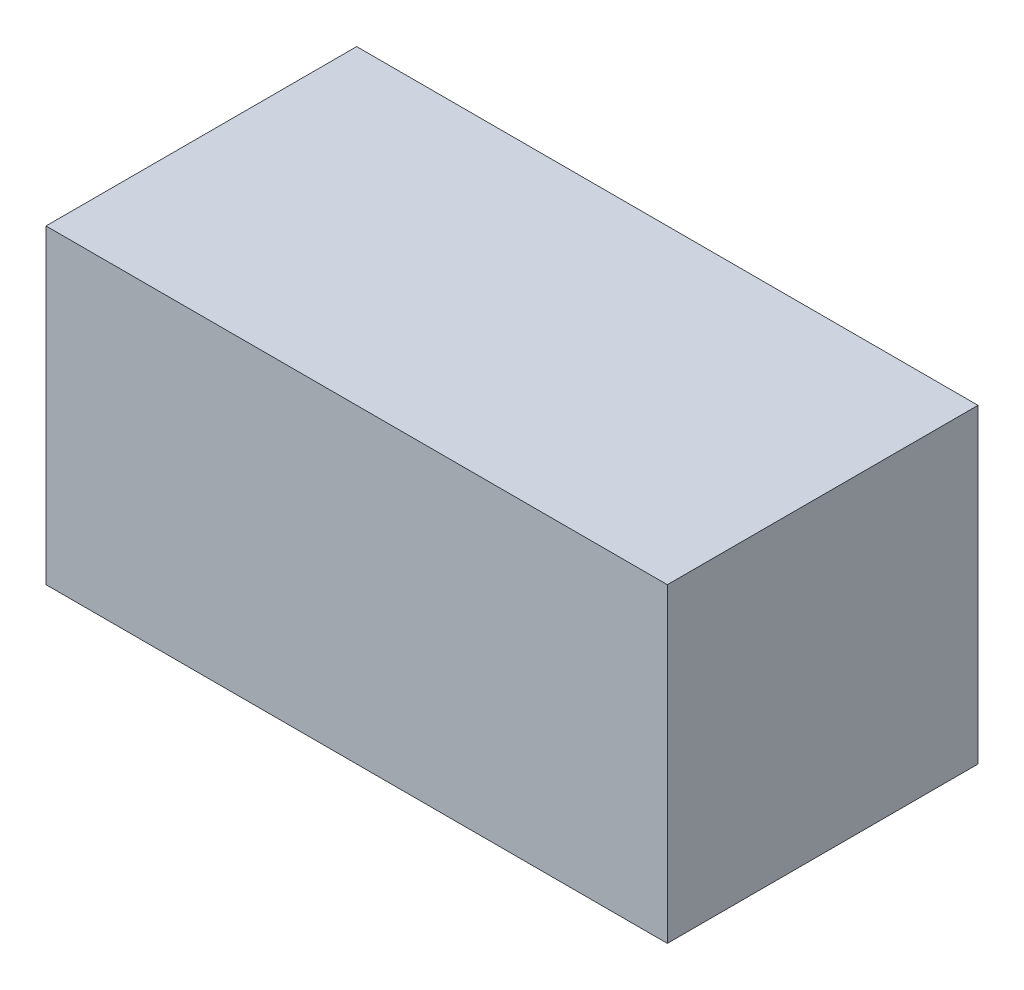
ISO-10303-21;
HEADER;
FILE_DESCRIPTION(('STEP AP214'),'2;1');
FILE_NAME('part.step','',(''),(''),'','','');
FILE_SCHEMA(('AUTOMOTIVE_DESIGN { 1 0 10303 214 1 1 1 1 }'));
ENDSEC;
DATA;
#1=APPLICATION_CONTEXT('core data for automotive mechanical design processes');
#2=APPLICATION_PROTOCOL_DEFINITION('international standard','automotive_design',2000,#1);
#3=PRODUCT_CONTEXT('',#1,'mechanical');
#4=PRODUCT('Part','Part','',(#3));
#5=PRODUCT_RELATED_PRODUCT_CATEGORY('part','',(#4));
#6=PRODUCT_DEFINITION_FORMATION('','',#4);
#7=PRODUCT_DEFINITION_CONTEXT('part definition',#1,'design');
#8=PRODUCT_DEFINITION('design','',#6,#7);
#9=PRODUCT_DEFINITION_SHAPE('','',#8);
#10=(LENGTH_UNIT() NAMED_UNIT(*) SI_UNIT(.MILLI.,.METRE.));
#11=(NAMED_UNIT(*) PLANE_ANGLE_UNIT() SI_UNIT($,.RADIAN.));
#12=(NAMED_UNIT(*) SI_UNIT($,.STERADIAN.) SOLID_ANGLE_UNIT());
#13=UNCERTAINTY_MEASURE_WITH_UNIT(LENGTH_MEASURE(1.E-05),#10,'distance_accuracy_value','');
#14=(GEOMETRIC_REPRESENTATION_CONTEXT(3) GLOBAL_UNCERTAINTY_ASSIGNED_CONTEXT((#13)) GLOBAL_UNIT_ASSIGNED_CONTEXT((#10,
#11,#12)) REPRESENTATION_CONTEXT('',''));
#15=CARTESIAN_POINT('',(0.,0.,0.));
#16=DIRECTION('',(0.,0.,1.));
#17=DIRECTION('',(1.,0.,0.));
#18=AXIS2_PLACEMENT_3D('',#15,#16,#17);
#19=CARTESIAN_POINT('',(-9.99999999999995,10.,-4.99999999999996));
#20=DIRECTION('',(1.,0.,0.));
#21=DIRECTION('',(0.,0.,-1.));
#22=AXIS2_PLACEMENT_3D('',#19,#20,#21);
#23=PLANE('',#22);
#24=DIRECTION('',(0.,0.,1.));
#25=VECTOR('',#24,1.);
#26=CARTESIAN_POINT('',(-9.99999999999995,0.,-4.99999999999996));
#27=LINE('',#26,#25);
#28=CARTESIAN_POINT('',(-9.99999999999995,0.,-4.99999999999996));
#29=VERTEX_POINT('',#28);
#30=CARTESIAN_POINT('',(-9.99999999999995,0.,5.00000000000004));
#31=VERTEX_POINT('',#30);
#32=EDGE_CURVE('E96',#29,#31,#27,.T.);
#33=ORIENTED_EDGE('',*,*,#32,.T.);
#34=DIRECTION('',(0.,-1.,0.));
#35=VECTOR('',#34,1.);
#36=CARTESIAN_POINT('',(-9.99999999999995,10.,5.00000000000004));
#37=LINE('',#36,#35);
#38=CARTESIAN_POINT('',(-9.99999999999995,10.,5.00000000000004));
#39=VERTEX_POINT('',#38);
#40=EDGE_CURVE('E11',#39,#31,#37,.T.);
#41=ORIENTED_EDGE('',*,*,#40,.F.);
#42=DIRECTION('',(0.,0.,1.));
#43=VECTOR('',#42,1.);
#44=CARTESIAN_POINT('',(-9.99999999999995,10.,-4.99999999999996));
#45=LINE('',#44,#43);
#46=CARTESIAN_POINT('',(-9.99999999999995,10.,-4.99999999999996));
#47=VERTEX_POINT('',#46);
#48=EDGE_CURVE('E84',#47,#39,#45,.T.);
#49=ORIENTED_EDGE('',*,*,#48,.F.);
#50=DIRECTION('',(0.,-1.,0.));
#51=VECTOR('',#50,1.);
#52=CARTESIAN_POINT('',(-9.99999999999995,10.,-4.99999999999996));
#53=LINE('',#52,#51);
#54=EDGE_CURVE('E92',#47,#29,#53,.T.);
#55=ORIENTED_EDGE('',*,*,#54,.T.);
#56=EDGE_LOOP('',(#33,#41,#49,#55));
#57=FACE_BOUND('',#56,.T.);
#58=ADVANCED_FACE('F33',(#57),#23,.F.);
#59=CARTESIAN_POINT('',(-9.99999999999995,10.,5.00000000000004));
#60=DIRECTION('',(0.,0.,-1.));
#61=DIRECTION('',(-1.,0.,0.));
#62=AXIS2_PLACEMENT_3D('',#59,#60,#61);
#63=PLANE('',#62);
#64=DIRECTION('',(1.,0.,0.));
#65=VECTOR('',#64,1.);
#66=CARTESIAN_POINT('',(-9.99999999999995,0.,5.00000000000004));
#67=LINE('',#66,#65);
#68=CARTESIAN_POINT('',(10.0000000000001,0.,5.00000000000004));
#69=VERTEX_POINT('',#68);
#70=EDGE_CURVE('E88',#31,#69,#67,.T.);
#71=ORIENTED_EDGE('',*,*,#70,.T.);
#72=DIRECTION('',(0.,-1.,0.));
#73=VECTOR('',#72,1.);
#74=CARTESIAN_POINT('',(10.0000000000001,10.,5.00000000000004));
#75=LINE('',#74,#73);
#76=CARTESIAN_POINT('',(10.0000000000001,10.,5.00000000000004));
#77=VERTEX_POINT('',#76);
#78=EDGE_CURVE('E41',#77,#69,#75,.T.);
#79=ORIENTED_EDGE('',*,*,#78,.F.);
#80=DIRECTION('',(1.,0.,0.));
#81=VECTOR('',#80,1.);
#82=CARTESIAN_POINT('',(-9.99999999999995,10.,5.00000000000004));
#83=LINE('',#82,#81);
#84=EDGE_CURVE('E79',#39,#77,#83,.T.);
#85=ORIENTED_EDGE('',*,*,#84,.F.);
#86=ORIENTED_EDGE('',*,*,#40,.T.);
#87=EDGE_LOOP('',(#71,#79,#85,#86));
#88=FACE_BOUND('',#87,.T.);
#89=ADVANCED_FACE('F87',(#88),#63,.F.);
#90=CARTESIAN_POINT('',(10.,10.,-4.99999999999996));
#91=DIRECTION('',(-1.,0.,0.));
#92=DIRECTION('',(0.,0.,1.));
#93=AXIS2_PLACEMENT_3D('',#90,#91,#92);
#94=PLANE('',#93);
#95=DIRECTION('',(0.,0.,-1.));
#96=VECTOR('',#95,1.);
#97=CARTESIAN_POINT('',(10.,0.,-4.99999999999996));
#98=LINE('',#97,#96);
#99=CARTESIAN_POINT('',(10.,0.,-4.99999999999996));
#100=VERTEX_POINT('',#99);
#101=EDGE_CURVE('E66',#69,#100,#98,.T.);
#102=ORIENTED_EDGE('',*,*,#101,.T.);
#103=DIRECTION('',(0.,-1.,0.));
#104=VECTOR('',#103,1.);
#105=CARTESIAN_POINT('',(10.,10.,-4.99999999999996));
#106=LINE('',#105,#104);
#107=CARTESIAN_POINT('',(10.,10.,-4.99999999999996));
#108=VERTEX_POINT('',#107);
#109=EDGE_CURVE('E89',#108,#100,#106,.T.);
#110=ORIENTED_EDGE('',*,*,#109,.F.);
#111=DIRECTION('',(0.,0.,-1.));
#112=VECTOR('',#111,1.);
#113=CARTESIAN_POINT('',(10.,10.,-4.99999999999996));
#114=LINE('',#113,#112);
#115=EDGE_CURVE('E82',#77,#108,#114,.T.);
#116=ORIENTED_EDGE('',*,*,#115,.F.);
#117=ORIENTED_EDGE('',*,*,#78,.T.);
#118=EDGE_LOOP('',(#102,#110,#116,#117));
#119=FACE_BOUND('',#118,.T.);
#120=ADVANCED_FACE('F90',(#119),#94,.F.);
#121=CARTESIAN_POINT('',(-9.99999999999995,10.,-4.99999999999996));
#122=DIRECTION('',(0.,0.,1.));
#123=DIRECTION('',(1.,0.,0.));
#124=AXIS2_PLACEMENT_3D('',#121,#122,#123);
#125=PLANE('',#124);
#126=DIRECTION('',(-1.,0.,0.));
#127=VECTOR('',#126,1.);
#128=CARTESIAN_POINT('',(-9.99999999999995,0.,-4.99999999999996));
#129=LINE('',#128,#127);
#130=EDGE_CURVE('E72',#100,#29,#129,.T.);
#131=ORIENTED_EDGE('',*,*,#130,.T.);
#132=ORIENTED_EDGE('',*,*,#54,.F.);
#133=DIRECTION('',(-1.,0.,0.));
#134=VECTOR('',#133,1.);
#135=CARTESIAN_POINT('',(-9.99999999999995,10.,-4.99999999999996));
#136=LINE('',#135,#134);
#137=EDGE_CURVE('E49',#108,#47,#136,.T.);
#138=ORIENTED_EDGE('',*,*,#137,.F.);
#139=ORIENTED_EDGE('',*,*,#109,.T.);
#140=EDGE_LOOP('',(#131,#132,#138,#139));
#141=FACE_BOUND('',#140,.T.);
#142=ADVANCED_FACE('F103',(#141),#125,.F.);
#143=CARTESIAN_POINT('',(0.,10.,0.));
#144=DIRECTION('',(0.,1.,0.));
#145=DIRECTION('',(0.,0.,1.));
#146=AXIS2_PLACEMENT_3D('',#143,#144,#145);
#147=PLANE('',#146);
#148=ORIENTED_EDGE('',*,*,#48,.T.);
#149=ORIENTED_EDGE('',*,*,#84,.T.);
#150=ORIENTED_EDGE('',*,*,#115,.T.);
#151=ORIENTED_EDGE('',*,*,#137,.T.);
#152=EDGE_LOOP('',(#148,#149,#150,#151));
#153=FACE_BOUND('',#152,.T.);
#154=ADVANCED_FACE('F80',(#153),#147,.T.);
#155=CARTESIAN_POINT('',(0.,0.,0.));
#156=DIRECTION('',(0.,1.,0.));
#157=DIRECTION('',(0.,0.,1.));
#158=AXIS2_PLACEMENT_3D('',#155,#156,#157);
#159=PLANE('',#158);
#160=ORIENTED_EDGE('',*,*,#32,.F.);
#161=ORIENTED_EDGE('',*,*,#130,.F.);
#162=ORIENTED_EDGE('',*,*,#101,.F.);
#163=ORIENTED_EDGE('',*,*,#70,.F.);
#164=EDGE_LOOP('',(#160,#161,#162,#163));
#165=FACE_BOUND('',#164,.T.);
#166=ADVANCED_FACE('F106',(#165),#159,.F.);
#167=CLOSED_SHELL('',(#58,#89,#120,#142,#154,#166));
#168=MANIFOLD_SOLID_BREP('B2',#167);
#169=ADVANCED_BREP_SHAPE_REPRESENTATION('',(#18,#168),#14);
#170=SHAPE_DEFINITION_REPRESENTATION(#9,#169);
ENDSEC;
END-ISO-10303-21;
